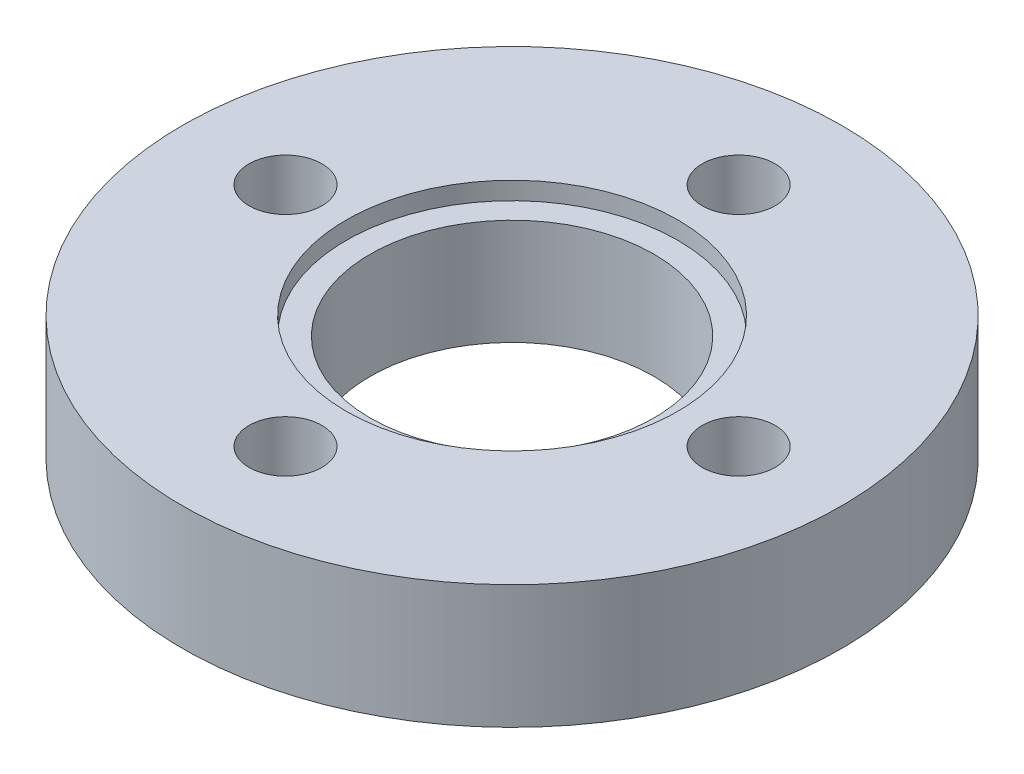
ISO-10303-21;
HEADER;
FILE_DESCRIPTION(('STEP AP214'),'2;1');
FILE_NAME('part.step','',(''),(''),'','','');
FILE_SCHEMA(('AUTOMOTIVE_DESIGN { 1 0 10303 214 1 1 1 1 }'));
ENDSEC;
DATA;
#1=APPLICATION_CONTEXT('core data for automotive mechanical design processes');
#2=APPLICATION_PROTOCOL_DEFINITION('international standard','automotive_design',2000,#1);
#3=PRODUCT_CONTEXT('',#1,'mechanical');
#4=PRODUCT('Part','Part','',(#3));
#5=PRODUCT_RELATED_PRODUCT_CATEGORY('part','',(#4));
#6=PRODUCT_DEFINITION_FORMATION('','',#4);
#7=PRODUCT_DEFINITION_CONTEXT('part definition',#1,'design');
#8=PRODUCT_DEFINITION('design','',#6,#7);
#9=PRODUCT_DEFINITION_SHAPE('','',#8);
#10=(LENGTH_UNIT() NAMED_UNIT(*) SI_UNIT(.MILLI.,.METRE.));
#11=(NAMED_UNIT(*) PLANE_ANGLE_UNIT() SI_UNIT($,.RADIAN.));
#12=(NAMED_UNIT(*) SI_UNIT($,.STERADIAN.) SOLID_ANGLE_UNIT());
#13=UNCERTAINTY_MEASURE_WITH_UNIT(LENGTH_MEASURE(1.E-05),#10,'distance_accuracy_value','');
#14=(GEOMETRIC_REPRESENTATION_CONTEXT(3) GLOBAL_UNCERTAINTY_ASSIGNED_CONTEXT((#13)) GLOBAL_UNIT_ASSIGNED_CONTEXT((#10,
#11,#12)) REPRESENTATION_CONTEXT('',''));
#15=CARTESIAN_POINT('',(0.,0.,0.));
#16=DIRECTION('',(0.,0.,1.));
#17=DIRECTION('',(1.,0.,0.));
#18=AXIS2_PLACEMENT_3D('',#15,#16,#17);
#19=CARTESIAN_POINT('',(0.,0.,0.));
#20=DIRECTION('',(0.,-1.,0.));
#21=DIRECTION('',(0.,0.,-1.));
#22=AXIS2_PLACEMENT_3D('',#19,#20,#21);
#23=CYLINDRICAL_SURFACE('',#22,8.7503);
#24=CARTESIAN_POINT('',(0.,6.5278,0.));
#25=DIRECTION('',(0.,-1.,0.));
#26=DIRECTION('',(0.,0.,-1.));
#27=AXIS2_PLACEMENT_3D('',#24,#25,#26);
#28=CIRCLE('',#27,8.7503);
#29=CARTESIAN_POINT('',(0.,6.5278,-8.7503));
#30=VERTEX_POINT('',#29);
#31=EDGE_CURVE('E10',#30,#30,#28,.T.);
#32=ORIENTED_EDGE('',*,*,#31,.F.);
#33=EDGE_LOOP('',(#32));
#34=FACE_BOUND('',#33,.T.);
#35=CARTESIAN_POINT('',(0.,0.,0.));
#36=DIRECTION('',(0.,-1.,0.));
#37=DIRECTION('',(0.,0.,-1.));
#38=AXIS2_PLACEMENT_3D('',#35,#36,#37);
#39=CIRCLE('',#38,8.7503);
#40=CARTESIAN_POINT('',(0.,0.,-8.7503));
#41=VERTEX_POINT('',#40);
#42=EDGE_CURVE('E68',#41,#41,#39,.T.);
#43=ORIENTED_EDGE('',*,*,#42,.T.);
#44=EDGE_LOOP('',(#43));
#45=FACE_BOUND('',#44,.T.);
#46=ADVANCED_FACE('F39',(#34,#45),#23,.F.);
#47=CARTESIAN_POINT('',(-8.7503,6.5278,0.));
#48=DIRECTION('',(0.,-1.,0.));
#49=DIRECTION('',(0.,0.,-1.));
#50=AXIS2_PLACEMENT_3D('',#47,#48,#49);
#51=PLANE('',#50);
#52=CARTESIAN_POINT('',(0.,6.5278,0.));
#53=DIRECTION('',(0.,-1.,0.));
#54=DIRECTION('',(0.,0.,-1.));
#55=AXIS2_PLACEMENT_3D('',#52,#53,#54);
#56=CIRCLE('',#55,10.2235);
#57=CARTESIAN_POINT('',(0.,6.5278,-10.2235));
#58=VERTEX_POINT('',#57);
#59=EDGE_CURVE('E46',#58,#58,#56,.T.);
#60=ORIENTED_EDGE('',*,*,#59,.F.);
#61=EDGE_LOOP('',(#60));
#62=FACE_BOUND('',#61,.T.);
#63=ORIENTED_EDGE('',*,*,#31,.T.);
#64=EDGE_LOOP('',(#63));
#65=FACE_BOUND('',#64,.T.);
#66=ADVANCED_FACE('F122',(#62,#65),#51,.F.);
#67=CARTESIAN_POINT('',(0.,0.,0.));
#68=DIRECTION('',(0.,-1.,0.));
#69=DIRECTION('',(0.,0.,-1.));
#70=AXIS2_PLACEMENT_3D('',#67,#68,#69);
#71=CYLINDRICAL_SURFACE('',#70,10.2235);
#72=CARTESIAN_POINT('',(0.,7.62,0.));
#73=DIRECTION('',(0.,-1.,0.));
#74=DIRECTION('',(0.,0.,-1.));
#75=AXIS2_PLACEMENT_3D('',#72,#73,#74);
#76=CIRCLE('',#75,10.2235);
#77=CARTESIAN_POINT('',(0.,7.62,-10.2235));
#78=VERTEX_POINT('',#77);
#79=EDGE_CURVE('E52',#78,#78,#76,.T.);
#80=ORIENTED_EDGE('',*,*,#79,.F.);
#81=EDGE_LOOP('',(#80));
#82=FACE_BOUND('',#81,.T.);
#83=ORIENTED_EDGE('',*,*,#59,.T.);
#84=EDGE_LOOP('',(#83));
#85=FACE_BOUND('',#84,.T.);
#86=ADVANCED_FACE('F109',(#82,#85),#71,.F.);
#87=CARTESIAN_POINT('',(-20.32,7.62,0.));
#88=DIRECTION('',(0.,-1.,0.));
#89=DIRECTION('',(0.,0.,-1.));
#90=AXIS2_PLACEMENT_3D('',#87,#88,#89);
#91=PLANE('',#90);
#92=CARTESIAN_POINT('',(0.,7.62,-13.97));
#93=DIRECTION('',(0.,1.,0.));
#94=DIRECTION('',(0.,0.,1.));
#95=AXIS2_PLACEMENT_3D('',#92,#93,#94);
#96=CIRCLE('',#95,2.2479);
#97=CARTESIAN_POINT('',(0.,7.62,-11.7221));
#98=VERTEX_POINT('',#97);
#99=EDGE_CURVE('E98',#98,#98,#96,.T.);
#100=ORIENTED_EDGE('',*,*,#99,.F.);
#101=EDGE_LOOP('',(#100));
#102=FACE_BOUND('',#101,.T.);
#103=CARTESIAN_POINT('',(-13.97,7.62,0.));
#104=DIRECTION('',(0.,1.,0.));
#105=DIRECTION('',(0.,0.,1.));
#106=AXIS2_PLACEMENT_3D('',#103,#104,#105);
#107=CIRCLE('',#106,2.2479);
#108=CARTESIAN_POINT('',(-13.97,7.62,2.2479));
#109=VERTEX_POINT('',#108);
#110=EDGE_CURVE('E91',#109,#109,#107,.T.);
#111=ORIENTED_EDGE('',*,*,#110,.F.);
#112=EDGE_LOOP('',(#111));
#113=FACE_BOUND('',#112,.T.);
#114=CARTESIAN_POINT('',(0.,7.62,13.97));
#115=DIRECTION('',(0.,1.,0.));
#116=DIRECTION('',(0.,0.,1.));
#117=AXIS2_PLACEMENT_3D('',#114,#115,#116);
#118=CIRCLE('',#117,2.2479);
#119=CARTESIAN_POINT('',(0.,7.62,16.2179));
#120=VERTEX_POINT('',#119);
#121=EDGE_CURVE('E83',#120,#120,#118,.T.);
#122=ORIENTED_EDGE('',*,*,#121,.F.);
#123=EDGE_LOOP('',(#122));
#124=FACE_BOUND('',#123,.T.);
#125=CARTESIAN_POINT('',(13.97,7.62,0.));
#126=DIRECTION('',(0.,1.,0.));
#127=DIRECTION('',(0.,0.,1.));
#128=AXIS2_PLACEMENT_3D('',#125,#126,#127);
#129=CIRCLE('',#128,2.2479);
#130=CARTESIAN_POINT('',(13.97,7.62,2.2479));
#131=VERTEX_POINT('',#130);
#132=EDGE_CURVE('E76',#131,#131,#129,.T.);
#133=ORIENTED_EDGE('',*,*,#132,.F.);
#134=EDGE_LOOP('',(#133));
#135=FACE_BOUND('',#134,.T.);
#136=CARTESIAN_POINT('',(0.,7.62,0.));
#137=DIRECTION('',(0.,-1.,0.));
#138=DIRECTION('',(0.,0.,-1.));
#139=AXIS2_PLACEMENT_3D('',#136,#137,#138);
#140=CIRCLE('',#139,20.32);
#141=CARTESIAN_POINT('',(0.,7.62,-20.32));
#142=VERTEX_POINT('',#141);
#143=EDGE_CURVE('E58',#142,#142,#140,.T.);
#144=ORIENTED_EDGE('',*,*,#143,.F.);
#145=EDGE_LOOP('',(#144));
#146=FACE_BOUND('',#145,.T.);
#147=ORIENTED_EDGE('',*,*,#79,.T.);
#148=EDGE_LOOP('',(#147));
#149=FACE_BOUND('',#148,.T.);
#150=ADVANCED_FACE('F105',(#102,#113,#124,#135,#146,#149),#91,.F.);
#151=CARTESIAN_POINT('',(0.,0.,0.));
#152=DIRECTION('',(0.,-1.,0.));
#153=DIRECTION('',(0.,0.,-1.));
#154=AXIS2_PLACEMENT_3D('',#151,#152,#153);
#155=CYLINDRICAL_SURFACE('',#154,20.32);
#156=CARTESIAN_POINT('',(0.,0.,0.));
#157=DIRECTION('',(0.,-1.,0.));
#158=DIRECTION('',(0.,0.,-1.));
#159=AXIS2_PLACEMENT_3D('',#156,#157,#158);
#160=CIRCLE('',#159,20.32);
#161=CARTESIAN_POINT('',(0.,0.,-20.32));
#162=VERTEX_POINT('',#161);
#163=EDGE_CURVE('E64',#162,#162,#160,.T.);
#164=ORIENTED_EDGE('',*,*,#163,.F.);
#165=EDGE_LOOP('',(#164));
#166=FACE_BOUND('',#165,.T.);
#167=ORIENTED_EDGE('',*,*,#143,.T.);
#168=EDGE_LOOP('',(#167));
#169=FACE_BOUND('',#168,.T.);
#170=ADVANCED_FACE('F108',(#166,#169),#155,.T.);
#171=CARTESIAN_POINT('',(-8.7503,0.,0.));
#172=DIRECTION('',(0.,1.,0.));
#173=DIRECTION('',(0.,0.,1.));
#174=AXIS2_PLACEMENT_3D('',#171,#172,#173);
#175=PLANE('',#174);
#176=CARTESIAN_POINT('',(0.,0.,-13.97));
#177=DIRECTION('',(0.,1.,0.));
#178=DIRECTION('',(0.,0.,1.));
#179=AXIS2_PLACEMENT_3D('',#176,#177,#178);
#180=CIRCLE('',#179,2.2479);
#181=CARTESIAN_POINT('',(0.,0.,-11.7221));
#182=VERTEX_POINT('',#181);
#183=EDGE_CURVE('E94',#182,#182,#180,.T.);
#184=ORIENTED_EDGE('',*,*,#183,.T.);
#185=EDGE_LOOP('',(#184));
#186=FACE_BOUND('',#185,.T.);
#187=CARTESIAN_POINT('',(-13.97,0.,0.));
#188=DIRECTION('',(0.,1.,0.));
#189=DIRECTION('',(0.,0.,1.));
#190=AXIS2_PLACEMENT_3D('',#187,#188,#189);
#191=CIRCLE('',#190,2.2479);
#192=CARTESIAN_POINT('',(-13.97,0.,2.2479));
#193=VERTEX_POINT('',#192);
#194=EDGE_CURVE('E87',#193,#193,#191,.T.);
#195=ORIENTED_EDGE('',*,*,#194,.T.);
#196=EDGE_LOOP('',(#195));
#197=FACE_BOUND('',#196,.T.);
#198=CARTESIAN_POINT('',(0.,0.,13.97));
#199=DIRECTION('',(0.,1.,0.));
#200=DIRECTION('',(0.,0.,1.));
#201=AXIS2_PLACEMENT_3D('',#198,#199,#200);
#202=CIRCLE('',#201,2.2479);
#203=CARTESIAN_POINT('',(0.,0.,16.2179));
#204=VERTEX_POINT('',#203);
#205=EDGE_CURVE('E80',#204,#204,#202,.T.);
#206=ORIENTED_EDGE('',*,*,#205,.T.);
#207=EDGE_LOOP('',(#206));
#208=FACE_BOUND('',#207,.T.);
#209=CARTESIAN_POINT('',(13.97,0.,0.));
#210=DIRECTION('',(0.,1.,0.));
#211=DIRECTION('',(0.,0.,1.));
#212=AXIS2_PLACEMENT_3D('',#209,#210,#211);
#213=CIRCLE('',#212,2.2479);
#214=CARTESIAN_POINT('',(13.97,0.,2.2479));
#215=VERTEX_POINT('',#214);
#216=EDGE_CURVE('E72',#215,#215,#213,.T.);
#217=ORIENTED_EDGE('',*,*,#216,.T.);
#218=EDGE_LOOP('',(#217));
#219=FACE_BOUND('',#218,.T.);
#220=ORIENTED_EDGE('',*,*,#42,.F.);
#221=EDGE_LOOP('',(#220));
#222=FACE_BOUND('',#221,.T.);
#223=ORIENTED_EDGE('',*,*,#163,.T.);
#224=EDGE_LOOP('',(#223));
#225=FACE_BOUND('',#224,.T.);
#226=ADVANCED_FACE('F135',(#186,#197,#208,#219,#222,#225),#175,.F.);
#227=CARTESIAN_POINT('',(13.97,7.62,0.));
#228=DIRECTION('',(0.,1.,0.));
#229=DIRECTION('',(0.,0.,1.));
#230=AXIS2_PLACEMENT_3D('',#227,#228,#229);
#231=CYLINDRICAL_SURFACE('',#230,2.2479);
#232=ORIENTED_EDGE('',*,*,#216,.F.);
#233=EDGE_LOOP('',(#232));
#234=FACE_BOUND('',#233,.T.);
#235=ORIENTED_EDGE('',*,*,#132,.T.);
#236=EDGE_LOOP('',(#235));
#237=FACE_BOUND('',#236,.T.);
#238=ADVANCED_FACE('F138',(#234,#237),#231,.F.);
#239=CARTESIAN_POINT('',(0.,7.62,13.97));
#240=DIRECTION('',(0.,1.,0.));
#241=DIRECTION('',(0.,0.,1.));
#242=AXIS2_PLACEMENT_3D('',#239,#240,#241);
#243=CYLINDRICAL_SURFACE('',#242,2.2479);
#244=ORIENTED_EDGE('',*,*,#205,.F.);
#245=EDGE_LOOP('',(#244));
#246=FACE_BOUND('',#245,.T.);
#247=ORIENTED_EDGE('',*,*,#121,.T.);
#248=EDGE_LOOP('',(#247));
#249=FACE_BOUND('',#248,.T.);
#250=ADVANCED_FACE('F151',(#246,#249),#243,.F.);
#251=CARTESIAN_POINT('',(-13.97,7.62,0.));
#252=DIRECTION('',(0.,1.,0.));
#253=DIRECTION('',(0.,0.,1.));
#254=AXIS2_PLACEMENT_3D('',#251,#252,#253);
#255=CYLINDRICAL_SURFACE('',#254,2.2479);
#256=ORIENTED_EDGE('',*,*,#194,.F.);
#257=EDGE_LOOP('',(#256));
#258=FACE_BOUND('',#257,.T.);
#259=ORIENTED_EDGE('',*,*,#110,.T.);
#260=EDGE_LOOP('',(#259));
#261=FACE_BOUND('',#260,.T.);
#262=ADVANCED_FACE('F155',(#258,#261),#255,.F.);
#263=CARTESIAN_POINT('',(0.,7.62,-13.97));
#264=DIRECTION('',(0.,1.,0.));
#265=DIRECTION('',(0.,0.,1.));
#266=AXIS2_PLACEMENT_3D('',#263,#264,#265);
#267=CYLINDRICAL_SURFACE('',#266,2.2479);
#268=ORIENTED_EDGE('',*,*,#183,.F.);
#269=EDGE_LOOP('',(#268));
#270=FACE_BOUND('',#269,.T.);
#271=ORIENTED_EDGE('',*,*,#99,.T.);
#272=EDGE_LOOP('',(#271));
#273=FACE_BOUND('',#272,.T.);
#274=ADVANCED_FACE('F103',(#270,#273),#267,.F.);
#275=CLOSED_SHELL('',(#46,#66,#86,#150,#170,#226,#238,#250,#262,#274));
#276=MANIFOLD_SOLID_BREP('B2',#275);
#277=ADVANCED_BREP_SHAPE_REPRESENTATION('',(#18,#276),#14);
#278=SHAPE_DEFINITION_REPRESENTATION(#9,#277);
ENDSEC;
END-ISO-10303-21;
